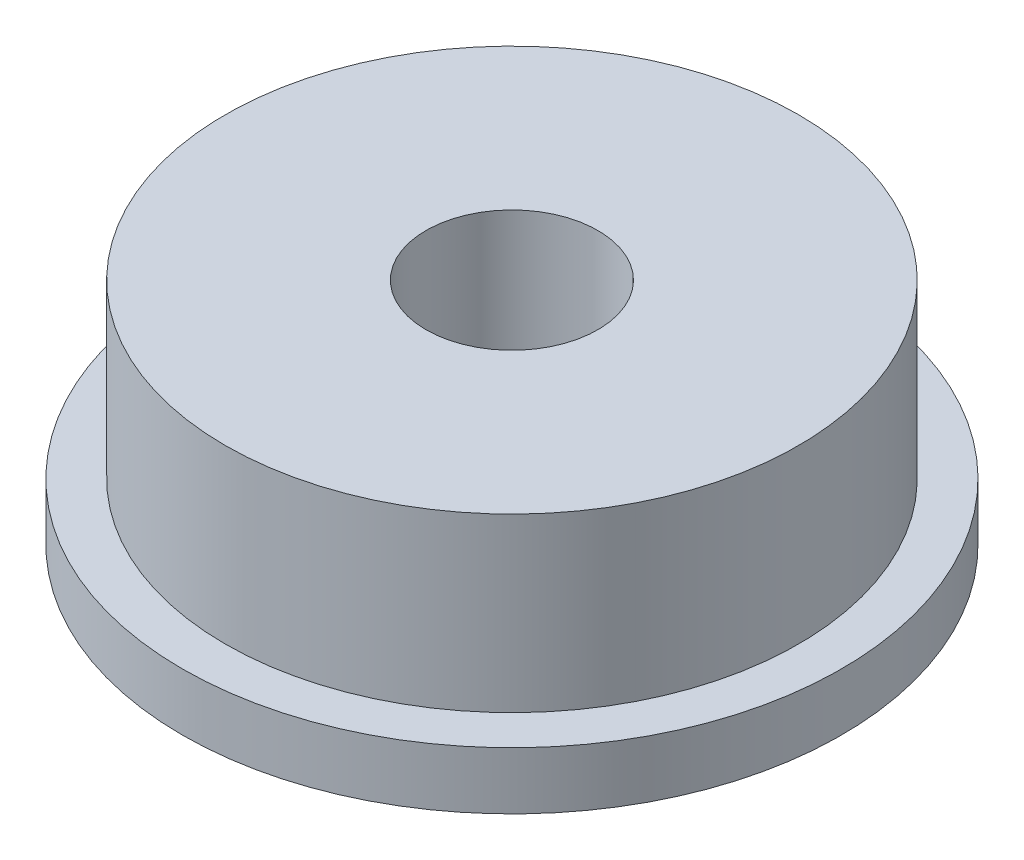
ISO-10303-21;
HEADER;
FILE_DESCRIPTION(('STEP AP214'),'2;1');
FILE_NAME('part.step','',(''),(''),'','','');
FILE_SCHEMA(('AUTOMOTIVE_DESIGN { 1 0 10303 214 1 1 1 1 }'));
ENDSEC;
DATA;
#1=APPLICATION_CONTEXT('core data for automotive mechanical design processes');
#2=APPLICATION_PROTOCOL_DEFINITION('international standard','automotive_design',2000,#1);
#3=PRODUCT_CONTEXT('',#1,'mechanical');
#4=PRODUCT('Part','Part','',(#3));
#5=PRODUCT_RELATED_PRODUCT_CATEGORY('part','',(#4));
#6=PRODUCT_DEFINITION_FORMATION('','',#4);
#7=PRODUCT_DEFINITION_CONTEXT('part definition',#1,'design');
#8=PRODUCT_DEFINITION('design','',#6,#7);
#9=PRODUCT_DEFINITION_SHAPE('','',#8);
#10=(LENGTH_UNIT() NAMED_UNIT(*) SI_UNIT(.MILLI.,.METRE.));
#11=(NAMED_UNIT(*) PLANE_ANGLE_UNIT() SI_UNIT($,.RADIAN.));
#12=(NAMED_UNIT(*) SI_UNIT($,.STERADIAN.) SOLID_ANGLE_UNIT());
#13=UNCERTAINTY_MEASURE_WITH_UNIT(LENGTH_MEASURE(1.E-05),#10,'distance_accuracy_value','');
#14=(GEOMETRIC_REPRESENTATION_CONTEXT(3) GLOBAL_UNCERTAINTY_ASSIGNED_CONTEXT((#13)) GLOBAL_UNIT_ASSIGNED_CONTEXT((#10,
#11,#12)) REPRESENTATION_CONTEXT('',''));
#15=CARTESIAN_POINT('',(0.,0.,0.));
#16=DIRECTION('',(0.,0.,1.));
#17=DIRECTION('',(1.,0.,0.));
#18=AXIS2_PLACEMENT_3D('',#15,#16,#17);
#19=CARTESIAN_POINT('',(0.,4.,0.));
#20=DIRECTION('',(0.,-1.,0.));
#21=DIRECTION('',(0.,0.,-1.));
#22=AXIS2_PLACEMENT_3D('',#19,#20,#21);
#23=CYLINDRICAL_SURFACE('',#22,1.5);
#24=CARTESIAN_POINT('',(0.,4.,0.));
#25=DIRECTION('',(0.,1.,0.));
#26=DIRECTION('',(0.,0.,1.));
#27=AXIS2_PLACEMENT_3D('',#24,#25,#26);
#28=CIRCLE('',#27,1.5);
#29=CARTESIAN_POINT('',(0.,4.,1.5));
#30=VERTEX_POINT('',#29);
#31=EDGE_CURVE('E40',#30,#30,#28,.T.);
#32=ORIENTED_EDGE('',*,*,#31,.T.);
#33=EDGE_LOOP('',(#32));
#34=FACE_BOUND('',#33,.T.);
#35=CARTESIAN_POINT('',(0.,0.,0.));
#36=DIRECTION('',(0.,1.,0.));
#37=DIRECTION('',(0.,0.,1.));
#38=AXIS2_PLACEMENT_3D('',#35,#36,#37);
#39=CIRCLE('',#38,1.5);
#40=CARTESIAN_POINT('',(0.,0.,1.5));
#41=VERTEX_POINT('',#40);
#42=EDGE_CURVE('E36',#41,#41,#39,.T.);
#43=ORIENTED_EDGE('',*,*,#42,.F.);
#44=EDGE_LOOP('',(#43));
#45=FACE_BOUND('',#44,.T.);
#46=ADVANCED_FACE('F33',(#34,#45),#23,.F.);
#47=CARTESIAN_POINT('',(0.,4.,0.));
#48=DIRECTION('',(0.,-1.,0.));
#49=DIRECTION('',(0.,0.,-1.));
#50=AXIS2_PLACEMENT_3D('',#47,#48,#49);
#51=CYLINDRICAL_SURFACE('',#50,5.);
#52=CARTESIAN_POINT('',(0.,1.,0.));
#53=DIRECTION('',(0.,1.,0.));
#54=DIRECTION('',(0.,0.,1.));
#55=AXIS2_PLACEMENT_3D('',#52,#53,#54);
#56=CIRCLE('',#55,5.);
#57=CARTESIAN_POINT('',(0.,1.,5.));
#58=VERTEX_POINT('',#57);
#59=EDGE_CURVE('E49',#58,#58,#56,.T.);
#60=ORIENTED_EDGE('',*,*,#59,.T.);
#61=EDGE_LOOP('',(#60));
#62=FACE_BOUND('',#61,.T.);
#63=CARTESIAN_POINT('',(0.,4.,0.));
#64=DIRECTION('',(0.,1.,0.));
#65=DIRECTION('',(0.,0.,1.));
#66=AXIS2_PLACEMENT_3D('',#63,#64,#65);
#67=CIRCLE('',#66,5.);
#68=CARTESIAN_POINT('',(0.,4.,5.));
#69=VERTEX_POINT('',#68);
#70=EDGE_CURVE('E10',#69,#69,#67,.T.);
#71=ORIENTED_EDGE('',*,*,#70,.F.);
#72=EDGE_LOOP('',(#71));
#73=FACE_BOUND('',#72,.T.);
#74=ADVANCED_FACE('F56',(#62,#73),#51,.T.);
#75=CARTESIAN_POINT('',(0.,4.,0.));
#76=DIRECTION('',(0.,1.,0.));
#77=DIRECTION('',(0.,0.,1.));
#78=AXIS2_PLACEMENT_3D('',#75,#76,#77);
#79=PLANE('',#78);
#80=ORIENTED_EDGE('',*,*,#31,.F.);
#81=EDGE_LOOP('',(#80));
#82=FACE_BOUND('',#81,.T.);
#83=ORIENTED_EDGE('',*,*,#70,.T.);
#84=EDGE_LOOP('',(#83));
#85=FACE_BOUND('',#84,.T.);
#86=ADVANCED_FACE('F73',(#82,#85),#79,.T.);
#87=CARTESIAN_POINT('',(0.,0.,0.));
#88=DIRECTION('',(0.,1.,0.));
#89=DIRECTION('',(0.,0.,1.));
#90=AXIS2_PLACEMENT_3D('',#87,#88,#89);
#91=PLANE('',#90);
#92=ORIENTED_EDGE('',*,*,#42,.T.);
#93=EDGE_LOOP('',(#92));
#94=FACE_BOUND('',#93,.T.);
#95=CARTESIAN_POINT('',(0.,0.,0.));
#96=DIRECTION('',(0.,1.,0.));
#97=DIRECTION('',(0.,0.,1.));
#98=AXIS2_PLACEMENT_3D('',#95,#96,#97);
#99=CIRCLE('',#98,5.75);
#100=CARTESIAN_POINT('',(0.,0.,5.75));
#101=VERTEX_POINT('',#100);
#102=EDGE_CURVE('E46',#101,#101,#99,.T.);
#103=ORIENTED_EDGE('',*,*,#102,.F.);
#104=EDGE_LOOP('',(#103));
#105=FACE_BOUND('',#104,.T.);
#106=ADVANCED_FACE('F68',(#94,#105),#91,.F.);
#107=CARTESIAN_POINT('',(0.,1.,0.));
#108=DIRECTION('',(0.,-1.,0.));
#109=DIRECTION('',(0.,0.,-1.));
#110=AXIS2_PLACEMENT_3D('',#107,#108,#109);
#111=CYLINDRICAL_SURFACE('',#110,5.75);
#112=CARTESIAN_POINT('',(0.,1.,0.));
#113=DIRECTION('',(0.,1.,0.));
#114=DIRECTION('',(0.,0.,1.));
#115=AXIS2_PLACEMENT_3D('',#112,#113,#114);
#116=CIRCLE('',#115,5.75);
#117=CARTESIAN_POINT('',(0.,1.,5.75));
#118=VERTEX_POINT('',#117);
#119=EDGE_CURVE('E50',#118,#118,#116,.T.);
#120=ORIENTED_EDGE('',*,*,#119,.F.);
#121=EDGE_LOOP('',(#120));
#122=FACE_BOUND('',#121,.T.);
#123=ORIENTED_EDGE('',*,*,#102,.T.);
#124=EDGE_LOOP('',(#123));
#125=FACE_BOUND('',#124,.T.);
#126=ADVANCED_FACE('F62',(#122,#125),#111,.T.);
#127=CARTESIAN_POINT('',(0.,1.,0.));
#128=DIRECTION('',(0.,1.,0.));
#129=DIRECTION('',(0.,0.,1.));
#130=AXIS2_PLACEMENT_3D('',#127,#128,#129);
#131=PLANE('',#130);
#132=ORIENTED_EDGE('',*,*,#59,.F.);
#133=EDGE_LOOP('',(#132));
#134=FACE_BOUND('',#133,.T.);
#135=ORIENTED_EDGE('',*,*,#119,.T.);
#136=EDGE_LOOP('',(#135));
#137=FACE_BOUND('',#136,.T.);
#138=ADVANCED_FACE('F59',(#134,#137),#131,.T.);
#139=CLOSED_SHELL('',(#46,#74,#86,#106,#126,#138));
#140=MANIFOLD_SOLID_BREP('B2',#139);
#141=ADVANCED_BREP_SHAPE_REPRESENTATION('',(#18,#140),#14);
#142=SHAPE_DEFINITION_REPRESENTATION(#9,#141);
ENDSEC;
END-ISO-10303-21;
